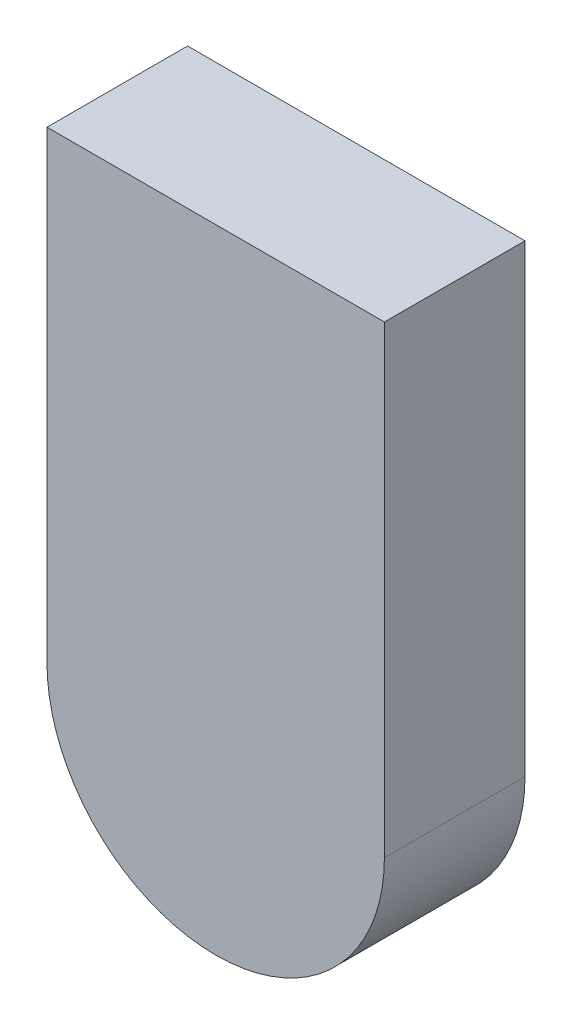
ISO-10303-21;
HEADER;
FILE_DESCRIPTION(('STEP AP214'),'2;1');
FILE_NAME('part.step','',(''),(''),'','','');
FILE_SCHEMA(('AUTOMOTIVE_DESIGN { 1 0 10303 214 1 1 1 1 }'));
ENDSEC;
DATA;
#1=APPLICATION_CONTEXT('core data for automotive mechanical design processes');
#2=APPLICATION_PROTOCOL_DEFINITION('international standard','automotive_design',2000,#1);
#3=PRODUCT_CONTEXT('',#1,'mechanical');
#4=PRODUCT('Part','Part','',(#3));
#5=PRODUCT_RELATED_PRODUCT_CATEGORY('part','',(#4));
#6=PRODUCT_DEFINITION_FORMATION('','',#4);
#7=PRODUCT_DEFINITION_CONTEXT('part definition',#1,'design');
#8=PRODUCT_DEFINITION('design','',#6,#7);
#9=PRODUCT_DEFINITION_SHAPE('','',#8);
#10=(LENGTH_UNIT() NAMED_UNIT(*) SI_UNIT(.MILLI.,.METRE.));
#11=(NAMED_UNIT(*) PLANE_ANGLE_UNIT() SI_UNIT($,.RADIAN.));
#12=(NAMED_UNIT(*) SI_UNIT($,.STERADIAN.) SOLID_ANGLE_UNIT());
#13=UNCERTAINTY_MEASURE_WITH_UNIT(LENGTH_MEASURE(1.E-05),#10,'distance_accuracy_value','');
#14=(GEOMETRIC_REPRESENTATION_CONTEXT(3) GLOBAL_UNCERTAINTY_ASSIGNED_CONTEXT((#13)) GLOBAL_UNIT_ASSIGNED_CONTEXT((#10,
#11,#12)) REPRESENTATION_CONTEXT('',''));
#15=CARTESIAN_POINT('',(0.,0.,0.));
#16=DIRECTION('',(0.,0.,1.));
#17=DIRECTION('',(1.,0.,0.));
#18=AXIS2_PLACEMENT_3D('',#15,#16,#17);
#19=CARTESIAN_POINT('',(0.13,4.05,0.));
#20=DIRECTION('',(0.,1.,0.));
#21=DIRECTION('',(1.,0.,0.));
#22=AXIS2_PLACEMENT_3D('',#19,#20,#21);
#23=PLANE('',#22);
#24=DIRECTION('',(0.,0.,1.));
#25=VECTOR('',#24,1.);
#26=CARTESIAN_POINT('',(0.13,4.05,0.));
#27=LINE('',#26,#25);
#28=CARTESIAN_POINT('',(0.13,4.05,0.));
#29=VERTEX_POINT('',#28);
#30=CARTESIAN_POINT('',(0.13,4.05,0.1));
#31=VERTEX_POINT('',#30);
#32=EDGE_CURVE('E11',#29,#31,#27,.T.);
#33=ORIENTED_EDGE('',*,*,#32,.T.);
#34=DIRECTION('',(1.,0.,0.));
#35=VECTOR('',#34,1.);
#36=CARTESIAN_POINT('',(0.13,4.05,0.1));
#37=LINE('',#36,#35);
#38=CARTESIAN_POINT('',(0.37,4.05,0.1));
#39=VERTEX_POINT('',#38);
#40=EDGE_CURVE('E24',#31,#39,#37,.T.);
#41=ORIENTED_EDGE('',*,*,#40,.T.);
#42=DIRECTION('',(0.,0.,1.));
#43=VECTOR('',#42,1.);
#44=CARTESIAN_POINT('',(0.37,4.05,0.));
#45=LINE('',#44,#43);
#46=CARTESIAN_POINT('',(0.37,4.05,0.));
#47=VERTEX_POINT('',#46);
#48=EDGE_CURVE('E85',#47,#39,#45,.T.);
#49=ORIENTED_EDGE('',*,*,#48,.F.);
#50=DIRECTION('',(1.,0.,0.));
#51=VECTOR('',#50,1.);
#52=CARTESIAN_POINT('',(0.13,4.05,0.));
#53=LINE('',#52,#51);
#54=EDGE_CURVE('E82',#29,#47,#53,.T.);
#55=ORIENTED_EDGE('',*,*,#54,.F.);
#56=EDGE_LOOP('',(#33,#41,#49,#55));
#57=FACE_BOUND('',#56,.T.);
#58=ADVANCED_FACE('F17',(#57),#23,.T.);
#59=CARTESIAN_POINT('',(0.37,4.05,0.));
#60=DIRECTION('',(1.,0.,0.));
#61=DIRECTION('',(0.,-1.,0.));
#62=AXIS2_PLACEMENT_3D('',#59,#60,#61);
#63=PLANE('',#62);
#64=ORIENTED_EDGE('',*,*,#48,.T.);
#65=DIRECTION('',(0.,-1.,0.));
#66=VECTOR('',#65,1.);
#67=CARTESIAN_POINT('',(0.37,4.05,0.1));
#68=LINE('',#67,#66);
#69=CARTESIAN_POINT('',(0.37,3.72,0.1));
#70=VERTEX_POINT('',#69);
#71=EDGE_CURVE('E80',#39,#70,#68,.T.);
#72=ORIENTED_EDGE('',*,*,#71,.T.);
#73=DIRECTION('',(0.,0.,1.));
#74=VECTOR('',#73,1.);
#75=CARTESIAN_POINT('',(0.37,3.72,0.));
#76=LINE('',#75,#74);
#77=CARTESIAN_POINT('',(0.37,3.72,0.));
#78=VERTEX_POINT('',#77);
#79=EDGE_CURVE('E60',#78,#70,#76,.T.);
#80=ORIENTED_EDGE('',*,*,#79,.F.);
#81=DIRECTION('',(0.,-1.,0.));
#82=VECTOR('',#81,1.);
#83=CARTESIAN_POINT('',(0.37,4.05,0.));
#84=LINE('',#83,#82);
#85=EDGE_CURVE('E76',#47,#78,#84,.T.);
#86=ORIENTED_EDGE('',*,*,#85,.F.);
#87=EDGE_LOOP('',(#64,#72,#80,#86));
#88=FACE_BOUND('',#87,.T.);
#89=ADVANCED_FACE('F89',(#88),#63,.T.);
#90=CARTESIAN_POINT('',(0.25,3.72,0.));
#91=DIRECTION('',(0.,0.,-1.));
#92=DIRECTION('',(1.,0.,0.));
#93=AXIS2_PLACEMENT_3D('',#90,#91,#92);
#94=CYLINDRICAL_SURFACE('',#93,0.12);
#95=CARTESIAN_POINT('',(0.25,3.72,0.));
#96=DIRECTION('',(0.,0.,1.));
#97=DIRECTION('',(1.,0.,0.));
#98=AXIS2_PLACEMENT_3D('',#95,#96,#97);
#99=CIRCLE('',#98,0.12);
#100=CARTESIAN_POINT('',(0.13,3.72,0.));
#101=VERTEX_POINT('',#100);
#102=EDGE_CURVE('E64',#101,#78,#99,.T.);
#103=ORIENTED_EDGE('',*,*,#102,.T.);
#104=ORIENTED_EDGE('',*,*,#79,.T.);
#105=CARTESIAN_POINT('',(0.25,3.72,0.1));
#106=DIRECTION('',(0.,0.,1.));
#107=DIRECTION('',(1.,0.,0.));
#108=AXIS2_PLACEMENT_3D('',#105,#106,#107);
#109=CIRCLE('',#108,0.12);
#110=CARTESIAN_POINT('',(0.13,3.72,0.1));
#111=VERTEX_POINT('',#110);
#112=EDGE_CURVE('E55',#111,#70,#109,.T.);
#113=ORIENTED_EDGE('',*,*,#112,.F.);
#114=DIRECTION('',(0.,0.,1.));
#115=VECTOR('',#114,1.);
#116=CARTESIAN_POINT('',(0.13,3.72,0.));
#117=LINE('',#116,#115);
#118=EDGE_CURVE('E59',#101,#111,#117,.T.);
#119=ORIENTED_EDGE('',*,*,#118,.F.);
#120=EDGE_LOOP('',(#103,#104,#113,#119));
#121=FACE_BOUND('',#120,.T.);
#122=ADVANCED_FACE('F58',(#121),#94,.T.);
#123=CARTESIAN_POINT('',(0.13,4.05,0.));
#124=DIRECTION('',(1.,0.,0.));
#125=DIRECTION('',(0.,-1.,0.));
#126=AXIS2_PLACEMENT_3D('',#123,#124,#125);
#127=PLANE('',#126);
#128=DIRECTION('',(0.,-1.,0.));
#129=VECTOR('',#128,1.);
#130=CARTESIAN_POINT('',(0.13,4.05,0.));
#131=LINE('',#130,#129);
#132=EDGE_CURVE('E69',#29,#101,#131,.T.);
#133=ORIENTED_EDGE('',*,*,#132,.T.);
#134=ORIENTED_EDGE('',*,*,#118,.T.);
#135=DIRECTION('',(0.,-1.,0.));
#136=VECTOR('',#135,1.);
#137=CARTESIAN_POINT('',(0.13,4.05,0.1));
#138=LINE('',#137,#136);
#139=EDGE_CURVE('E67',#31,#111,#138,.T.);
#140=ORIENTED_EDGE('',*,*,#139,.F.);
#141=ORIENTED_EDGE('',*,*,#32,.F.);
#142=EDGE_LOOP('',(#133,#134,#140,#141));
#143=FACE_BOUND('',#142,.T.);
#144=ADVANCED_FACE('F66',(#143),#127,.F.);
#145=CARTESIAN_POINT('',(0.25,3.849490847913,0.));
#146=DIRECTION('',(0.,0.,-1.));
#147=DIRECTION('',(-1.,0.,0.));
#148=AXIS2_PLACEMENT_3D('',#145,#146,#147);
#149=PLANE('',#148);
#150=ORIENTED_EDGE('',*,*,#54,.T.);
#151=ORIENTED_EDGE('',*,*,#85,.T.);
#152=ORIENTED_EDGE('',*,*,#102,.F.);
#153=ORIENTED_EDGE('',*,*,#132,.F.);
#154=EDGE_LOOP('',(#150,#151,#152,#153));
#155=FACE_BOUND('',#154,.T.);
#156=ADVANCED_FACE('F91',(#155),#149,.T.);
#157=CARTESIAN_POINT('',(0.25,3.849490847913,0.1));
#158=DIRECTION('',(0.,0.,-1.));
#159=DIRECTION('',(-1.,0.,0.));
#160=AXIS2_PLACEMENT_3D('',#157,#158,#159);
#161=PLANE('',#160);
#162=ORIENTED_EDGE('',*,*,#139,.T.);
#163=ORIENTED_EDGE('',*,*,#112,.T.);
#164=ORIENTED_EDGE('',*,*,#71,.F.);
#165=ORIENTED_EDGE('',*,*,#40,.F.);
#166=EDGE_LOOP('',(#162,#163,#164,#165));
#167=FACE_BOUND('',#166,.T.);
#168=ADVANCED_FACE('F71',(#167),#161,.F.);
#169=CLOSED_SHELL('',(#58,#89,#122,#144,#156,#168));
#170=MANIFOLD_SOLID_BREP('B1',#169);
#171=ADVANCED_BREP_SHAPE_REPRESENTATION('',(#18,#170),#14);
#172=SHAPE_DEFINITION_REPRESENTATION(#9,#171);
ENDSEC;
END-ISO-10303-21;
